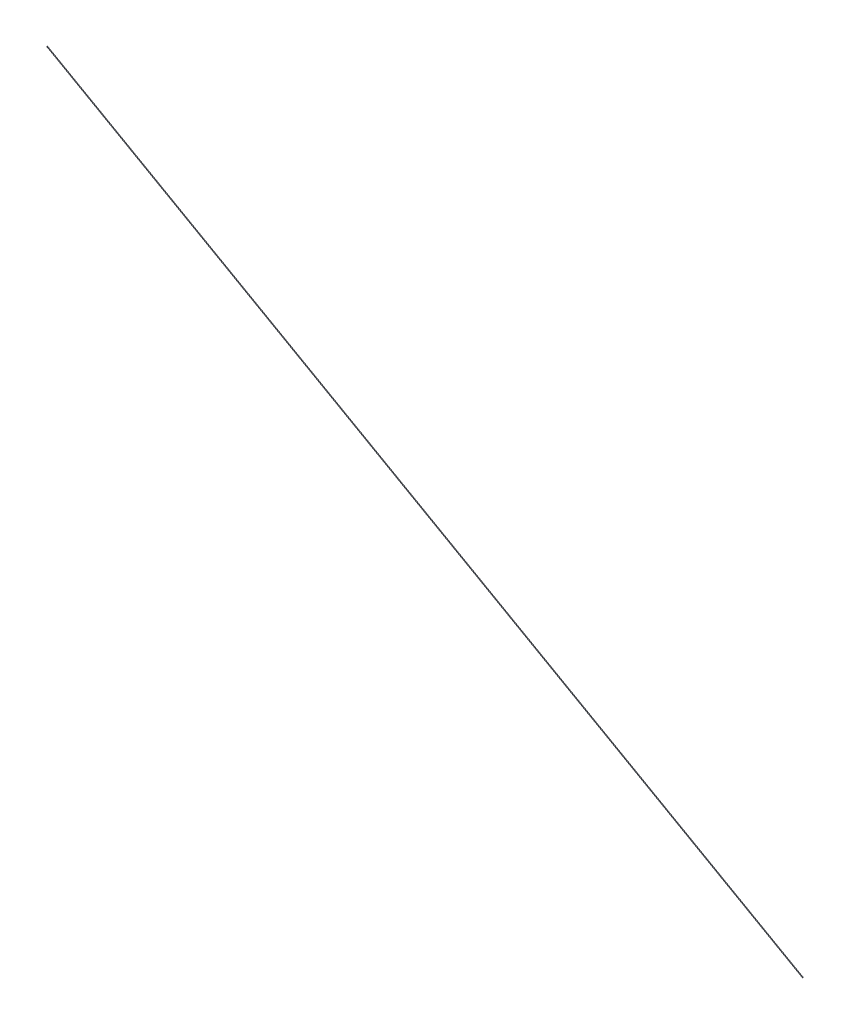
ISO-10303-21;
HEADER;
FILE_DESCRIPTION(('STEP AP214'),'2;1');
FILE_NAME('part.step','',(''),(''),'','','');
FILE_SCHEMA(('AUTOMOTIVE_DESIGN { 1 0 10303 214 1 1 1 1 }'));
ENDSEC;
DATA;
#1=APPLICATION_CONTEXT('core data for automotive mechanical design processes');
#2=APPLICATION_PROTOCOL_DEFINITION('international standard','automotive_design',2000,#1);
#3=PRODUCT_CONTEXT('',#1,'mechanical');
#4=PRODUCT('Part','Part','',(#3));
#5=PRODUCT_RELATED_PRODUCT_CATEGORY('part','',(#4));
#6=PRODUCT_DEFINITION_FORMATION('','',#4);
#7=PRODUCT_DEFINITION_CONTEXT('part definition',#1,'design');
#8=PRODUCT_DEFINITION('design','',#6,#7);
#9=PRODUCT_DEFINITION_SHAPE('','',#8);
#10=(LENGTH_UNIT() NAMED_UNIT(*) SI_UNIT(.MILLI.,.METRE.));
#11=(NAMED_UNIT(*) PLANE_ANGLE_UNIT() SI_UNIT($,.RADIAN.));
#12=(NAMED_UNIT(*) SI_UNIT($,.STERADIAN.) SOLID_ANGLE_UNIT());
#13=UNCERTAINTY_MEASURE_WITH_UNIT(LENGTH_MEASURE(1.E-05),#10,'distance_accuracy_value','');
#14=(GEOMETRIC_REPRESENTATION_CONTEXT(3) GLOBAL_UNCERTAINTY_ASSIGNED_CONTEXT((#13)) GLOBAL_UNIT_ASSIGNED_CONTEXT((#10,
#11,#12)) REPRESENTATION_CONTEXT('',''));
#15=CARTESIAN_POINT('',(0.,0.,0.));
#16=DIRECTION('',(0.,0.,1.));
#17=DIRECTION('',(1.,0.,0.));
#18=AXIS2_PLACEMENT_3D('',#15,#16,#17);
#19=CARTESIAN_POINT('',(-60.,0.,0.));
#20=DIRECTION('',(0.,0.,1.));
#21=DIRECTION('',(1.,0.,0.));
#22=AXIS2_PLACEMENT_3D('',#19,#20,#21);
#23=PLANE('',#22);
#24=CARTESIAN_POINT('',(-60.,0.,0.));
#25=DIRECTION('',(0.,0.,1.));
#26=DIRECTION('',(1.,0.,0.));
#27=AXIS2_PLACEMENT_3D('',#24,#25,#26);
#28=CIRCLE('',#27,4.99999999999976);
#29=CARTESIAN_POINT('',(-55.,0.,0.));
#30=VERTEX_POINT('',#29);
#31=EDGE_CURVE('E24',#30,#30,#28,.T.);
#32=ORIENTED_EDGE('',*,*,#31,.F.);
#33=EDGE_LOOP('',(#32));
#34=FACE_BOUND('',#33,.T.);
#35=ADVANCED_FACE('F17',(#34),#23,.F.);
#36=CARTESIAN_POINT('',(-6663.67926975568,4388.52424147822,410.636455942057));
#37=DIRECTION('',(0.,0.,1.));
#38=DIRECTION('',(1.,0.,0.));
#39=AXIS2_PLACEMENT_3D('',#36,#37,#38);
#40=PLANE('',#39);
#41=CARTESIAN_POINT('',(-6663.67926975568,4388.52424147822,410.636455942057));
#42=DIRECTION('',(0.,0.,1.));
#43=DIRECTION('',(1.,0.,0.));
#44=AXIS2_PLACEMENT_3D('',#41,#42,#43);
#45=CIRCLE('',#44,4.99999999999976);
#46=CARTESIAN_POINT('',(-6658.67926975568,4388.52424147822,410.636455942057));
#47=VERTEX_POINT('',#46);
#48=EDGE_CURVE('E11',#47,#47,#45,.T.);
#49=ORIENTED_EDGE('',*,*,#48,.T.);
#50=EDGE_LOOP('',(#49));
#51=FACE_BOUND('',#50,.T.);
#52=ADVANCED_FACE('F31',(#51),#40,.T.);
#53=CARTESIAN_POINT('',(-55.,0.,0.));
#54=CARTESIAN_POINT('',(-6658.67926975568,4388.52424147822,410.636455942057));
#55=CARTESIAN_POINT('',(-55.0000000000002,9.9999999999995,0.));
#56=CARTESIAN_POINT('',(-6658.67926975567,4398.52424147822,410.636455942056));
#57=CARTESIAN_POINT('',(-64.9999999999996,9.9999999999995,0.));
#58=CARTESIAN_POINT('',(-6668.67926975568,4398.52424147822,410.636455942056));
#59=CARTESIAN_POINT('',(-65.,0.,0.));
#60=CARTESIAN_POINT('',(-6668.67926975568,4388.52424147822,410.636455942057));
#61=CARTESIAN_POINT('',(-64.9999999999996,-9.9999999999995,0.));
#62=CARTESIAN_POINT('',(-6668.67926975568,4378.52424147822,410.636455942056));
#63=CARTESIAN_POINT('',(-55.0000000000002,-9.9999999999995,0.));
#64=CARTESIAN_POINT('',(-6658.67926975567,4378.52424147822,410.636455942056));
#65=CARTESIAN_POINT('',(-55.,0.,0.));
#66=CARTESIAN_POINT('',(-6658.67926975568,4388.52424147822,410.636455942057));
#67=(BOUNDED_SURFACE() B_SPLINE_SURFACE(3,1,((#53,#54),(#55,#56),(#57,#58),(#59,#60),(#61,#62),
(#63,#64),(#65,#66)),.UNSPECIFIED.,.T.,.F.,.F.) B_SPLINE_SURFACE_WITH_KNOTS((4,3,4),(2,2),(0.,
0.5,1.),(0.,1.),.UNSPECIFIED.) GEOMETRIC_REPRESENTATION_ITEM() RATIONAL_B_SPLINE_SURFACE(((1.,
1.),(0.333333333333334,0.333333333333334),(0.333333333333334,0.333333333333334),(1.,1.),
(0.333333333333334,0.333333333333334),(0.333333333333334,0.333333333333334),(1.,1.))) REPRESENTATION_ITEM('') SURFACE());
#68=ORIENTED_EDGE('',*,*,#48,.F.);
#69=EDGE_LOOP('',(#68));
#70=FACE_BOUND('',#69,.T.);
#71=ORIENTED_EDGE('',*,*,#31,.T.);
#72=EDGE_LOOP('',(#71));
#73=FACE_BOUND('',#72,.T.);
#74=ADVANCED_FACE('F33',(#70,#73),#67,.T.);
#75=CLOSED_SHELL('',(#35,#52,#74));
#76=MANIFOLD_SOLID_BREP('B1',#75);
#77=ADVANCED_BREP_SHAPE_REPRESENTATION('',(#18,#76),#14);
#78=SHAPE_DEFINITION_REPRESENTATION(#9,#77);
ENDSEC;
END-ISO-10303-21;
